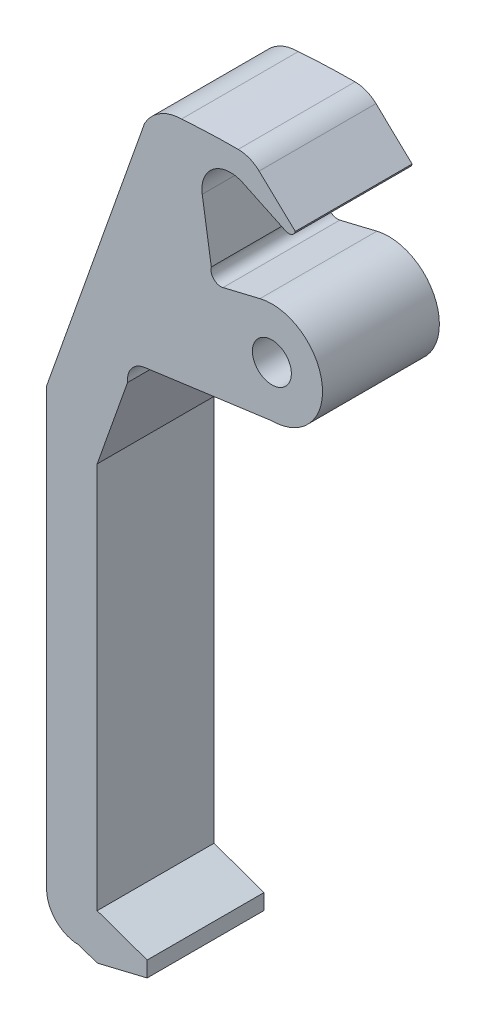
ISO-10303-21;
HEADER;
FILE_DESCRIPTION(('STEP AP214'),'2;1');
FILE_NAME('part.step','',(''),(''),'','','');
FILE_SCHEMA(('AUTOMOTIVE_DESIGN { 1 0 10303 214 1 1 1 1 }'));
ENDSEC;
DATA;
#1=APPLICATION_CONTEXT('core data for automotive mechanical design processes');
#2=APPLICATION_PROTOCOL_DEFINITION('international standard','automotive_design',2000,#1);
#3=PRODUCT_CONTEXT('',#1,'mechanical');
#4=PRODUCT('Part','Part','',(#3));
#5=PRODUCT_RELATED_PRODUCT_CATEGORY('part','',(#4));
#6=PRODUCT_DEFINITION_FORMATION('','',#4);
#7=PRODUCT_DEFINITION_CONTEXT('part definition',#1,'design');
#8=PRODUCT_DEFINITION('design','',#6,#7);
#9=PRODUCT_DEFINITION_SHAPE('','',#8);
#10=(LENGTH_UNIT() NAMED_UNIT(*) SI_UNIT(.MILLI.,.METRE.));
#11=(NAMED_UNIT(*) PLANE_ANGLE_UNIT() SI_UNIT($,.RADIAN.));
#12=(NAMED_UNIT(*) SI_UNIT($,.STERADIAN.) SOLID_ANGLE_UNIT());
#13=UNCERTAINTY_MEASURE_WITH_UNIT(LENGTH_MEASURE(1.E-05),#10,'distance_accuracy_value','');
#14=(GEOMETRIC_REPRESENTATION_CONTEXT(3) GLOBAL_UNCERTAINTY_ASSIGNED_CONTEXT((#13)) GLOBAL_UNIT_ASSIGNED_CONTEXT((#10,
#11,#12)) REPRESENTATION_CONTEXT('',''));
#15=CARTESIAN_POINT('',(0.,0.,0.));
#16=DIRECTION('',(0.,0.,1.));
#17=DIRECTION('',(1.,0.,0.));
#18=AXIS2_PLACEMENT_3D('',#15,#16,#17);
#19=CARTESIAN_POINT('',(-4.51569484594409,5.22423534933692,6.));
#20=DIRECTION('',(0.,0.,-1.));
#21=DIRECTION('',(-1.,0.,0.));
#22=AXIS2_PLACEMENT_3D('',#19,#20,#21);
#23=PLANE('',#22);
#24=CARTESIAN_POINT('',(-4.51569484594409,5.22423534933692,6.));
#25=DIRECTION('',(0.,0.,1.));
#26=DIRECTION('',(-1.,0.,0.));
#27=AXIS2_PLACEMENT_3D('',#24,#25,#26);
#28=CIRCLE('',#27,2.60114486006778);
#29=CARTESIAN_POINT('',(-4.51569484594409,2.62309048926914,6.));
#30=VERTEX_POINT('',#29);
#31=CARTESIAN_POINT('',(-5.12560105891966,7.75286521438851,6.));
#32=VERTEX_POINT('',#31);
#33=EDGE_CURVE('E290',#30,#32,#28,.T.);
#34=ORIENTED_EDGE('',*,*,#33,.T.);
#35=DIRECTION('',(-0.972121892890541,-0.234476065650446,0.));
#36=VECTOR('',#35,1.);
#37=CARTESIAN_POINT('',(-5.12560105891966,7.75286521438851,6.));
#38=LINE('',#37,#36);
#39=CARTESIAN_POINT('',(-7.02560105891966,7.29458469628273,6.));
#40=VERTEX_POINT('',#39);
#41=EDGE_CURVE('E142',#32,#40,#38,.T.);
#42=ORIENTED_EDGE('',*,*,#41,.T.);
#43=CARTESIAN_POINT('',(-7.14283909174488,7.780645642728,6.));
#44=DIRECTION('',(0.,0.,-1.));
#45=DIRECTION('',(-1.,0.,0.));
#46=AXIS2_PLACEMENT_3D('',#43,#44,#45);
#47=CIRCLE('',#46,0.5);
#48=CARTESIAN_POINT('',(-7.62521914813079,7.91221114428951,6.));
#49=VERTEX_POINT('',#48);
#50=EDGE_CURVE('E367',#40,#49,#47,.T.);
#51=ORIENTED_EDGE('',*,*,#50,.T.);
#52=DIRECTION('',(-0.153679161681778,0.988120799935304,0.));
#53=VECTOR('',#52,1.);
#54=CARTESIAN_POINT('',(-7.62521914813079,7.91221114428951,6.));
#55=LINE('',#54,#53);
#56=CARTESIAN_POINT('',(-8.09179923133065,10.9122111442895,6.));
#57=VERTEX_POINT('',#56);
#58=EDGE_CURVE('E387',#49,#57,#55,.T.);
#59=ORIENTED_EDGE('',*,*,#58,.T.);
#60=CARTESIAN_POINT('',(-6.64156246662134,11.137761674402,6.));
#61=DIRECTION('',(0.,0.,-1.));
#62=DIRECTION('',(-1.,0.,0.));
#63=AXIS2_PLACEMENT_3D('',#60,#61,#62);
#64=CIRCLE('',#63,1.46767152842473);
#65=CARTESIAN_POINT('',(-6.01507453611189,12.4650041497149,6.));
#66=VERTEX_POINT('',#65);
#67=EDGE_CURVE('E383',#57,#66,#64,.T.);
#68=ORIENTED_EDGE('',*,*,#67,.T.);
#69=DIRECTION('',(0.904318472906124,-0.426858406922876,0.));
#70=VECTOR('',#69,1.);
#71=CARTESIAN_POINT('',(-6.01507453611189,12.4650041497149,6.));
#72=LINE('',#71,#70);
#73=CARTESIAN_POINT('',(-3.79657696969492,11.4178240186712,6.));
#74=VERTEX_POINT('',#73);
#75=EDGE_CURVE('E386',#66,#74,#72,.T.);
#76=ORIENTED_EDGE('',*,*,#75,.T.);
#77=CARTESIAN_POINT('',(-3.64917409070544,11.7301035574313,6.));
#78=DIRECTION('',(0.,0.,1.));
#79=DIRECTION('',(1.,0.,0.));
#80=AXIS2_PLACEMENT_3D('',#77,#78,#79);
#81=CIRCLE('',#80,0.345320313712618);
#82=CARTESIAN_POINT('',(-3.31403457068977,11.6468712248541,6.));
#83=VERTEX_POINT('',#82);
#84=EDGE_CURVE('E391',#74,#83,#81,.T.);
#85=ORIENTED_EDGE('',*,*,#84,.T.);
#86=DIRECTION('',(-0.726400675585128,0.68727145911166,0.));
#87=VECTOR('',#86,1.);
#88=CARTESIAN_POINT('',(-5.17045698150236,13.4032932408152,6.));
#89=LINE('',#88,#87);
#90=CARTESIAN_POINT('',(-5.17045698150236,13.4032932408152,6.));
#91=VERTEX_POINT('',#90);
#92=EDGE_CURVE('E398',#83,#91,#89,.T.);
#93=ORIENTED_EDGE('',*,*,#92,.T.);
#94=CARTESIAN_POINT('',(-6.24608790659032,12.2664221830907,6.));
#95=DIRECTION('',(0.,0.,1.));
#96=DIRECTION('',(1.,0.,0.));
#97=AXIS2_PLACEMENT_3D('',#94,#95,#96);
#98=CIRCLE('',#97,1.56507433973511);
#99=CARTESIAN_POINT('',(-6.24608790659033,13.8314965228258,6.));
#100=VERTEX_POINT('',#99);
#101=EDGE_CURVE('E401',#91,#100,#98,.T.);
#102=ORIENTED_EDGE('',*,*,#101,.T.);
#103=CARTESIAN_POINT('',(-6.24608790659035,-25.6395132829265,6.));
#104=DIRECTION('',(0.,0.,1.));
#105=DIRECTION('',(1.,0.,0.));
#106=AXIS2_PLACEMENT_3D('',#103,#104,#105);
#107=CIRCLE('',#106,39.4710098057523);
#108=CARTESIAN_POINT('',(-9.15758206236001,13.7239700089102,6.));
#109=VERTEX_POINT('',#108);
#110=EDGE_CURVE('E404',#100,#109,#107,.T.);
#111=ORIENTED_EDGE('',*,*,#110,.T.);
#112=CARTESIAN_POINT('',(-9.14121457217017,11.5551703749708,6.));
#113=DIRECTION('',(0.,0.,1.));
#114=DIRECTION('',(1.,0.,0.));
#115=AXIS2_PLACEMENT_3D('',#112,#113,#114);
#116=CIRCLE('',#115,2.16886139412158);
#117=CARTESIAN_POINT('',(-11.0574923889032,12.5709651751189,6.));
#118=VERTEX_POINT('',#117);
#119=EDGE_CURVE('E407',#109,#118,#116,.T.);
#120=ORIENTED_EDGE('',*,*,#119,.T.);
#121=DIRECTION('',(-0.334181818049273,-0.942508627273662,0.));
#122=VECTOR('',#121,1.);
#123=CARTESIAN_POINT('',(-11.0574923889032,12.5709651751189,6.));
#124=LINE('',#123,#122);
#125=CARTESIAN_POINT('',(-16.0830356074001,-1.60280965146838,6.));
#126=VERTEX_POINT('',#125);
#127=EDGE_CURVE('E410',#118,#126,#124,.T.);
#128=ORIENTED_EDGE('',*,*,#127,.T.);
#129=DIRECTION('',(0.,-1.,0.));
#130=VECTOR('',#129,1.);
#131=CARTESIAN_POINT('',(-16.0830356074001,-1.60280965146838,6.));
#132=LINE('',#131,#130);
#133=CARTESIAN_POINT('',(-16.0830356074001,-23.98824008561,6.));
#134=VERTEX_POINT('',#133);
#135=EDGE_CURVE('E413',#126,#134,#132,.T.);
#136=ORIENTED_EDGE('',*,*,#135,.T.);
#137=CARTESIAN_POINT('',(-14.4317624100835,-23.98824008561,6.));
#138=DIRECTION('',(0.,0.,1.));
#139=DIRECTION('',(1.,0.,0.));
#140=AXIS2_PLACEMENT_3D('',#137,#138,#139);
#141=CIRCLE('',#140,1.65127319731652);
#142=CARTESIAN_POINT('',(-14.4317624100835,-25.6395132829265,6.));
#143=VERTEX_POINT('',#142);
#144=EDGE_CURVE('E416',#134,#143,#141,.T.);
#145=ORIENTED_EDGE('',*,*,#144,.T.);
#146=DIRECTION('',(0.942508627273663,-0.334181818049271,0.));
#147=VECTOR('',#146,1.);
#148=CARTESIAN_POINT('',(-14.4317624100835,-25.6395132829265,6.));
#149=LINE('',#148,#147);
#150=CARTESIAN_POINT('',(-13.4868082342411,-25.9745622101387,6.));
#151=VERTEX_POINT('',#150);
#152=EDGE_CURVE('E419',#143,#151,#149,.T.);
#153=ORIENTED_EDGE('',*,*,#152,.T.);
#154=DIRECTION('',(0.972121892890541,0.234476065650445,0.));
#155=VECTOR('',#154,1.);
#156=CARTESIAN_POINT('',(-13.4868082342411,-25.9745622101387,6.));
#157=LINE('',#156,#155);
#158=CARTESIAN_POINT('',(-10.9206699236474,-25.3556089498703,6.));
#159=VERTEX_POINT('',#158);
#160=EDGE_CURVE('E422',#151,#159,#157,.T.);
#161=ORIENTED_EDGE('',*,*,#160,.T.);
#162=DIRECTION('',(0.,1.,0.));
#163=VECTOR('',#162,1.);
#164=CARTESIAN_POINT('',(-10.9206699236474,-25.3556089498703,6.));
#165=LINE('',#164,#163);
#166=CARTESIAN_POINT('',(-10.9206699236474,-24.5561648234885,6.));
#167=VERTEX_POINT('',#166);
#168=EDGE_CURVE('E425',#159,#167,#165,.T.);
#169=ORIENTED_EDGE('',*,*,#168,.T.);
#170=DIRECTION('',(-0.942508627273662,0.334181818049272,0.));
#171=VECTOR('',#170,1.);
#172=CARTESIAN_POINT('',(-10.9206699236474,-24.5561648234885,6.));
#173=LINE('',#172,#171);
#174=CARTESIAN_POINT('',(-13.4868082342411,-23.6462985992602,6.));
#175=VERTEX_POINT('',#174);
#176=EDGE_CURVE('E428',#167,#175,#173,.T.);
#177=ORIENTED_EDGE('',*,*,#176,.T.);
#178=DIRECTION('',(0.,1.,0.));
#179=VECTOR('',#178,1.);
#180=CARTESIAN_POINT('',(-13.4868082342411,-3.77637007716617,6.));
#181=LINE('',#180,#179);
#182=CARTESIAN_POINT('',(-13.4868082342411,-3.77637007716617,6.));
#183=VERTEX_POINT('',#182);
#184=EDGE_CURVE('E203',#175,#183,#181,.T.);
#185=ORIENTED_EDGE('',*,*,#184,.T.);
#186=DIRECTION('',(0.334181818049273,0.942508627273662,0.));
#187=VECTOR('',#186,1.);
#188=CARTESIAN_POINT('',(-11.9273381380971,0.621876446749646,6.));
#189=LINE('',#188,#187);
#190=CARTESIAN_POINT('',(-11.9273381380971,0.621876446749646,6.));
#191=VERTEX_POINT('',#190);
#192=EDGE_CURVE('E197',#183,#191,#189,.T.);
#193=ORIENTED_EDGE('',*,*,#192,.T.);
#194=CARTESIAN_POINT('',(-10.9206699236474,0.727710893237151,6.));
#195=DIRECTION('',(0.,0.,-1.));
#196=DIRECTION('',(1.,0.,0.));
#197=AXIS2_PLACEMENT_3D('',#194,#195,#196);
#198=CIRCLE('',#197,1.01221629311453);
#199=CARTESIAN_POINT('',(-11.0574923889032,1.73063732974576,6.));
#200=VERTEX_POINT('',#199);
#201=EDGE_CURVE('E201',#191,#200,#198,.T.);
#202=ORIENTED_EDGE('',*,*,#201,.T.);
#203=DIRECTION('',(0.990822261339684,0.135171174566604,0.));
#204=VECTOR('',#203,1.);
#205=CARTESIAN_POINT('',(-4.51569484594409,2.62309048926914,6.));
#206=LINE('',#205,#204);
#207=EDGE_CURVE('E57',#200,#30,#206,.T.);
#208=ORIENTED_EDGE('',*,*,#207,.T.);
#209=EDGE_LOOP('',(#34,#42,#51,#59,#68,#76,#85,#93,#102,#111,#120,#128,#136,#145,#153,#161,#169,
#177,#185,#193,#202,#208));
#210=FACE_BOUND('',#209,.T.);
#211=CARTESIAN_POINT('',(-4.51569484594409,5.22423534933692,6.));
#212=DIRECTION('',(0.,0.,1.));
#213=DIRECTION('',(1.,0.,0.));
#214=AXIS2_PLACEMENT_3D('',#211,#212,#213);
#215=CIRCLE('',#214,1.);
#216=CARTESIAN_POINT('',(-3.51569484594409,5.22423534933692,6.));
#217=VERTEX_POINT('',#216);
#218=EDGE_CURVE('E230',#217,#217,#215,.T.);
#219=ORIENTED_EDGE('',*,*,#218,.F.);
#220=EDGE_LOOP('',(#219));
#221=FACE_BOUND('',#220,.T.);
#222=ADVANCED_FACE('F39',(#210,#221),#23,.F.);
#223=CARTESIAN_POINT('',(-4.51569484594409,5.22423534933692,0.));
#224=DIRECTION('',(0.,0.,-1.));
#225=DIRECTION('',(-1.,0.,0.));
#226=AXIS2_PLACEMENT_3D('',#223,#224,#225);
#227=PLANE('',#226);
#228=CARTESIAN_POINT('',(-4.51569484594409,5.22423534933692,0.));
#229=DIRECTION('',(0.,0.,1.));
#230=DIRECTION('',(-1.,0.,0.));
#231=AXIS2_PLACEMENT_3D('',#228,#229,#230);
#232=CIRCLE('',#231,2.60114486006778);
#233=CARTESIAN_POINT('',(-4.51569484594409,2.62309048926914,0.));
#234=VERTEX_POINT('',#233);
#235=CARTESIAN_POINT('',(-5.12560105891966,7.75286521438851,0.));
#236=VERTEX_POINT('',#235);
#237=EDGE_CURVE('E225',#234,#236,#232,.T.);
#238=ORIENTED_EDGE('',*,*,#237,.F.);
#239=DIRECTION('',(0.990822261339684,0.135171174566604,0.));
#240=VECTOR('',#239,1.);
#241=CARTESIAN_POINT('',(-4.51569484594409,2.62309048926914,0.));
#242=LINE('',#241,#240);
#243=CARTESIAN_POINT('',(-11.0574923889032,1.73063732974576,0.));
#244=VERTEX_POINT('',#243);
#245=EDGE_CURVE('E134',#244,#234,#242,.T.);
#246=ORIENTED_EDGE('',*,*,#245,.F.);
#247=CARTESIAN_POINT('',(-10.9206699236474,0.727710893237151,0.));
#248=DIRECTION('',(0.,0.,-1.));
#249=DIRECTION('',(1.,0.,0.));
#250=AXIS2_PLACEMENT_3D('',#247,#248,#249);
#251=CIRCLE('',#250,1.01221629311453);
#252=CARTESIAN_POINT('',(-11.9273381380971,0.621876446749646,0.));
#253=VERTEX_POINT('',#252);
#254=EDGE_CURVE('E128',#253,#244,#251,.T.);
#255=ORIENTED_EDGE('',*,*,#254,.F.);
#256=DIRECTION('',(0.334181818049273,0.942508627273662,0.));
#257=VECTOR('',#256,1.);
#258=CARTESIAN_POINT('',(-11.9273381380971,0.621876446749646,0.));
#259=LINE('',#258,#257);
#260=CARTESIAN_POINT('',(-13.4868082342411,-3.77637007716617,0.));
#261=VERTEX_POINT('',#260);
#262=EDGE_CURVE('E212',#261,#253,#259,.T.);
#263=ORIENTED_EDGE('',*,*,#262,.F.);
#264=DIRECTION('',(0.,1.,0.));
#265=VECTOR('',#264,1.);
#266=CARTESIAN_POINT('',(-13.4868082342411,-3.77637007716617,0.));
#267=LINE('',#266,#265);
#268=CARTESIAN_POINT('',(-13.4868082342411,-23.6462985992602,0.));
#269=VERTEX_POINT('',#268);
#270=EDGE_CURVE('E281',#269,#261,#267,.T.);
#271=ORIENTED_EDGE('',*,*,#270,.F.);
#272=DIRECTION('',(-0.942508627273662,0.334181818049272,0.));
#273=VECTOR('',#272,1.);
#274=CARTESIAN_POINT('',(-10.9206699236474,-24.5561648234885,0.));
#275=LINE('',#274,#273);
#276=CARTESIAN_POINT('',(-10.9206699236474,-24.5561648234885,0.));
#277=VERTEX_POINT('',#276);
#278=EDGE_CURVE('E278',#277,#269,#275,.T.);
#279=ORIENTED_EDGE('',*,*,#278,.F.);
#280=DIRECTION('',(0.,1.,0.));
#281=VECTOR('',#280,1.);
#282=CARTESIAN_POINT('',(-10.9206699236474,-25.3556089498703,0.));
#283=LINE('',#282,#281);
#284=CARTESIAN_POINT('',(-10.9206699236474,-25.3556089498703,0.));
#285=VERTEX_POINT('',#284);
#286=EDGE_CURVE('E275',#285,#277,#283,.T.);
#287=ORIENTED_EDGE('',*,*,#286,.F.);
#288=DIRECTION('',(0.972121892890541,0.234476065650445,0.));
#289=VECTOR('',#288,1.);
#290=CARTESIAN_POINT('',(-13.4868082342411,-25.9745622101387,0.));
#291=LINE('',#290,#289);
#292=CARTESIAN_POINT('',(-13.4868082342411,-25.9745622101387,0.));
#293=VERTEX_POINT('',#292);
#294=EDGE_CURVE('E272',#293,#285,#291,.T.);
#295=ORIENTED_EDGE('',*,*,#294,.F.);
#296=DIRECTION('',(0.942508627273663,-0.334181818049271,0.));
#297=VECTOR('',#296,1.);
#298=CARTESIAN_POINT('',(-14.4317624100835,-25.6395132829265,0.));
#299=LINE('',#298,#297);
#300=CARTESIAN_POINT('',(-14.4317624100835,-25.6395132829265,0.));
#301=VERTEX_POINT('',#300);
#302=EDGE_CURVE('E269',#301,#293,#299,.T.);
#303=ORIENTED_EDGE('',*,*,#302,.F.);
#304=CARTESIAN_POINT('',(-14.4317624100835,-23.98824008561,0.));
#305=DIRECTION('',(0.,0.,1.));
#306=DIRECTION('',(1.,0.,0.));
#307=AXIS2_PLACEMENT_3D('',#304,#305,#306);
#308=CIRCLE('',#307,1.65127319731652);
#309=CARTESIAN_POINT('',(-16.0830356074001,-23.98824008561,0.));
#310=VERTEX_POINT('',#309);
#311=EDGE_CURVE('E266',#310,#301,#308,.T.);
#312=ORIENTED_EDGE('',*,*,#311,.F.);
#313=DIRECTION('',(0.,-1.,0.));
#314=VECTOR('',#313,1.);
#315=CARTESIAN_POINT('',(-16.0830356074001,-1.60280965146838,0.));
#316=LINE('',#315,#314);
#317=CARTESIAN_POINT('',(-16.0830356074001,-1.60280965146838,0.));
#318=VERTEX_POINT('',#317);
#319=EDGE_CURVE('E263',#318,#310,#316,.T.);
#320=ORIENTED_EDGE('',*,*,#319,.F.);
#321=DIRECTION('',(-0.334181818049273,-0.942508627273662,0.));
#322=VECTOR('',#321,1.);
#323=CARTESIAN_POINT('',(-11.0574923889032,12.5709651751189,0.));
#324=LINE('',#323,#322);
#325=CARTESIAN_POINT('',(-11.0574923889032,12.5709651751189,0.));
#326=VERTEX_POINT('',#325);
#327=EDGE_CURVE('E260',#326,#318,#324,.T.);
#328=ORIENTED_EDGE('',*,*,#327,.F.);
#329=CARTESIAN_POINT('',(-9.14121457217017,11.5551703749708,0.));
#330=DIRECTION('',(0.,0.,1.));
#331=DIRECTION('',(1.,0.,0.));
#332=AXIS2_PLACEMENT_3D('',#329,#330,#331);
#333=CIRCLE('',#332,2.16886139412158);
#334=CARTESIAN_POINT('',(-9.15758206236001,13.7239700089102,0.));
#335=VERTEX_POINT('',#334);
#336=EDGE_CURVE('E257',#335,#326,#333,.T.);
#337=ORIENTED_EDGE('',*,*,#336,.F.);
#338=CARTESIAN_POINT('',(-6.24608790659035,-25.6395132829265,0.));
#339=DIRECTION('',(0.,0.,1.));
#340=DIRECTION('',(1.,0.,0.));
#341=AXIS2_PLACEMENT_3D('',#338,#339,#340);
#342=CIRCLE('',#341,39.4710098057523);
#343=CARTESIAN_POINT('',(-6.24608790659033,13.8314965228258,0.));
#344=VERTEX_POINT('',#343);
#345=EDGE_CURVE('E254',#344,#335,#342,.T.);
#346=ORIENTED_EDGE('',*,*,#345,.F.);
#347=CARTESIAN_POINT('',(-6.24608790659032,12.2664221830907,0.));
#348=DIRECTION('',(0.,0.,1.));
#349=DIRECTION('',(1.,0.,0.));
#350=AXIS2_PLACEMENT_3D('',#347,#348,#349);
#351=CIRCLE('',#350,1.56507433973511);
#352=CARTESIAN_POINT('',(-5.17045698150236,13.4032932408152,0.));
#353=VERTEX_POINT('',#352);
#354=EDGE_CURVE('E251',#353,#344,#351,.T.);
#355=ORIENTED_EDGE('',*,*,#354,.F.);
#356=DIRECTION('',(-0.726400675585128,0.68727145911166,0.));
#357=VECTOR('',#356,1.);
#358=CARTESIAN_POINT('',(-5.17045698150236,13.4032932408152,0.));
#359=LINE('',#358,#357);
#360=CARTESIAN_POINT('',(-3.31403457068977,11.6468712248541,0.));
#361=VERTEX_POINT('',#360);
#362=EDGE_CURVE('E248',#361,#353,#359,.T.);
#363=ORIENTED_EDGE('',*,*,#362,.F.);
#364=CARTESIAN_POINT('',(-3.64917409070544,11.7301035574313,0.));
#365=DIRECTION('',(0.,0.,1.));
#366=DIRECTION('',(1.,0.,0.));
#367=AXIS2_PLACEMENT_3D('',#364,#365,#366);
#368=CIRCLE('',#367,0.345320313712618);
#369=CARTESIAN_POINT('',(-3.79657696969492,11.4178240186712,0.));
#370=VERTEX_POINT('',#369);
#371=EDGE_CURVE('E245',#370,#361,#368,.T.);
#372=ORIENTED_EDGE('',*,*,#371,.F.);
#373=DIRECTION('',(0.904318472906124,-0.426858406922876,0.));
#374=VECTOR('',#373,1.);
#375=CARTESIAN_POINT('',(-6.01507453611189,12.4650041497149,0.));
#376=LINE('',#375,#374);
#377=CARTESIAN_POINT('',(-6.01507453611189,12.4650041497149,0.));
#378=VERTEX_POINT('',#377);
#379=EDGE_CURVE('E242',#378,#370,#376,.T.);
#380=ORIENTED_EDGE('',*,*,#379,.F.);
#381=CARTESIAN_POINT('',(-6.64156246662134,11.137761674402,0.));
#382=DIRECTION('',(0.,0.,-1.));
#383=DIRECTION('',(-1.,0.,0.));
#384=AXIS2_PLACEMENT_3D('',#381,#382,#383);
#385=CIRCLE('',#384,1.46767152842473);
#386=CARTESIAN_POINT('',(-8.09179923133065,10.9122111442895,0.));
#387=VERTEX_POINT('',#386);
#388=EDGE_CURVE('E239',#387,#378,#385,.T.);
#389=ORIENTED_EDGE('',*,*,#388,.F.);
#390=DIRECTION('',(-0.153679161681778,0.988120799935304,0.));
#391=VECTOR('',#390,1.);
#392=CARTESIAN_POINT('',(-7.62521914813079,7.91221114428951,0.));
#393=LINE('',#392,#391);
#394=CARTESIAN_POINT('',(-7.62521914813079,7.91221114428951,0.));
#395=VERTEX_POINT('',#394);
#396=EDGE_CURVE('E236',#395,#387,#393,.T.);
#397=ORIENTED_EDGE('',*,*,#396,.F.);
#398=CARTESIAN_POINT('',(-7.14283909174488,7.780645642728,0.));
#399=DIRECTION('',(0.,0.,-1.));
#400=DIRECTION('',(-1.,0.,0.));
#401=AXIS2_PLACEMENT_3D('',#398,#399,#400);
#402=CIRCLE('',#401,0.5);
#403=CARTESIAN_POINT('',(-7.02560105891966,7.29458469628273,0.));
#404=VERTEX_POINT('',#403);
#405=EDGE_CURVE('E233',#404,#395,#402,.T.);
#406=ORIENTED_EDGE('',*,*,#405,.F.);
#407=DIRECTION('',(-0.972121892890541,-0.234476065650446,0.));
#408=VECTOR('',#407,1.);
#409=CARTESIAN_POINT('',(-5.12560105891966,7.75286521438851,0.));
#410=LINE('',#409,#408);
#411=EDGE_CURVE('E229',#236,#404,#410,.T.);
#412=ORIENTED_EDGE('',*,*,#411,.F.);
#413=EDGE_LOOP('',(#238,#246,#255,#263,#271,#279,#287,#295,#303,#312,#320,#328,#337,#346,#355,
#363,#372,#380,#389,#397,#406,#412));
#414=FACE_BOUND('',#413,.T.);
#415=CARTESIAN_POINT('',(-4.51569484594409,5.22423534933692,0.));
#416=DIRECTION('',(0.,0.,1.));
#417=DIRECTION('',(1.,0.,0.));
#418=AXIS2_PLACEMENT_3D('',#415,#416,#417);
#419=CIRCLE('',#418,1.);
#420=CARTESIAN_POINT('',(-3.51569484594409,5.22423534933692,0.));
#421=VERTEX_POINT('',#420);
#422=EDGE_CURVE('E707',#421,#421,#419,.T.);
#423=ORIENTED_EDGE('',*,*,#422,.T.);
#424=EDGE_LOOP('',(#423));
#425=FACE_BOUND('',#424,.T.);
#426=ADVANCED_FACE('F371',(#414,#425),#227,.T.);
#427=CARTESIAN_POINT('',(-4.51569484594409,5.22423534933692,6.));
#428=DIRECTION('',(0.,0.,-1.));
#429=DIRECTION('',(-1.,0.,0.));
#430=AXIS2_PLACEMENT_3D('',#427,#428,#429);
#431=CYLINDRICAL_SURFACE('',#430,2.60114486006778);
#432=ORIENTED_EDGE('',*,*,#237,.T.);
#433=DIRECTION('',(0.,0.,-1.));
#434=VECTOR('',#433,1.);
#435=CARTESIAN_POINT('',(-5.12560105891966,7.75286521438851,6.));
#436=LINE('',#435,#434);
#437=EDGE_CURVE('E11',#32,#236,#436,.T.);
#438=ORIENTED_EDGE('',*,*,#437,.F.);
#439=ORIENTED_EDGE('',*,*,#33,.F.);
#440=DIRECTION('',(0.,0.,-1.));
#441=VECTOR('',#440,1.);
#442=CARTESIAN_POINT('',(-4.51569484594409,2.62309048926914,6.));
#443=LINE('',#442,#441);
#444=EDGE_CURVE('E221',#30,#234,#443,.T.);
#445=ORIENTED_EDGE('',*,*,#444,.T.);
#446=EDGE_LOOP('',(#432,#438,#439,#445));
#447=FACE_BOUND('',#446,.T.);
#448=ADVANCED_FACE('F41',(#447),#431,.T.);
#449=CARTESIAN_POINT('',(-5.12560105891966,7.75286521438851,6.));
#450=DIRECTION('',(0.234476065650446,-0.972121892890541,0.));
#451=DIRECTION('',(0.972121892890541,0.234476065650446,0.));
#452=AXIS2_PLACEMENT_3D('',#449,#450,#451);
#453=PLANE('',#452);
#454=ORIENTED_EDGE('',*,*,#411,.T.);
#455=DIRECTION('',(0.,0.,-1.));
#456=VECTOR('',#455,1.);
#457=CARTESIAN_POINT('',(-7.02560105891966,7.29458469628273,6.));
#458=LINE('',#457,#456);
#459=EDGE_CURVE('E49',#40,#404,#458,.T.);
#460=ORIENTED_EDGE('',*,*,#459,.F.);
#461=ORIENTED_EDGE('',*,*,#41,.F.);
#462=ORIENTED_EDGE('',*,*,#437,.T.);
#463=EDGE_LOOP('',(#454,#460,#461,#462));
#464=FACE_BOUND('',#463,.T.);
#465=ADVANCED_FACE('F464',(#464),#453,.F.);
#466=CARTESIAN_POINT('',(-7.14283909174488,7.780645642728,6.));
#467=DIRECTION('',(0.,0.,-1.));
#468=DIRECTION('',(-1.,0.,0.));
#469=AXIS2_PLACEMENT_3D('',#466,#467,#468);
#470=CYLINDRICAL_SURFACE('',#469,0.5);
#471=ORIENTED_EDGE('',*,*,#405,.T.);
#472=DIRECTION('',(0.,0.,-1.));
#473=VECTOR('',#472,1.);
#474=CARTESIAN_POINT('',(-7.62521914813079,7.91221114428951,6.));
#475=LINE('',#474,#473);
#476=EDGE_CURVE('E357',#49,#395,#475,.T.);
#477=ORIENTED_EDGE('',*,*,#476,.F.);
#478=ORIENTED_EDGE('',*,*,#50,.F.);
#479=ORIENTED_EDGE('',*,*,#459,.T.);
#480=EDGE_LOOP('',(#471,#477,#478,#479));
#481=FACE_BOUND('',#480,.T.);
#482=ADVANCED_FACE('F365',(#481),#470,.F.);
#483=CARTESIAN_POINT('',(-7.62521914813079,7.91221114428951,6.));
#484=DIRECTION('',(-0.988120799935304,-0.153679161681778,0.));
#485=DIRECTION('',(0.153679161681778,-0.988120799935305,0.));
#486=AXIS2_PLACEMENT_3D('',#483,#484,#485);
#487=PLANE('',#486);
#488=ORIENTED_EDGE('',*,*,#396,.T.);
#489=DIRECTION('',(0.,0.,-1.));
#490=VECTOR('',#489,1.);
#491=CARTESIAN_POINT('',(-8.09179923133065,10.9122111442895,6.));
#492=LINE('',#491,#490);
#493=EDGE_CURVE('E353',#57,#387,#492,.T.);
#494=ORIENTED_EDGE('',*,*,#493,.F.);
#495=ORIENTED_EDGE('',*,*,#58,.F.);
#496=ORIENTED_EDGE('',*,*,#476,.T.);
#497=EDGE_LOOP('',(#488,#494,#495,#496));
#498=FACE_BOUND('',#497,.T.);
#499=ADVANCED_FACE('F377',(#498),#487,.F.);
#500=CARTESIAN_POINT('',(-6.64156246662134,11.137761674402,6.));
#501=DIRECTION('',(0.,0.,-1.));
#502=DIRECTION('',(-1.,0.,0.));
#503=AXIS2_PLACEMENT_3D('',#500,#501,#502);
#504=CYLINDRICAL_SURFACE('',#503,1.46767152842473);
#505=ORIENTED_EDGE('',*,*,#388,.T.);
#506=DIRECTION('',(0.,0.,-1.));
#507=VECTOR('',#506,1.);
#508=CARTESIAN_POINT('',(-6.01507453611189,12.4650041497149,6.));
#509=LINE('',#508,#507);
#510=EDGE_CURVE('E349',#66,#378,#509,.T.);
#511=ORIENTED_EDGE('',*,*,#510,.F.);
#512=ORIENTED_EDGE('',*,*,#67,.F.);
#513=ORIENTED_EDGE('',*,*,#493,.T.);
#514=EDGE_LOOP('',(#505,#511,#512,#513));
#515=FACE_BOUND('',#514,.T.);
#516=ADVANCED_FACE('F381',(#515),#504,.F.);
#517=CARTESIAN_POINT('',(-6.01507453611189,12.4650041497149,6.));
#518=DIRECTION('',(0.426858406922876,0.904318472906124,0.));
#519=DIRECTION('',(-0.904318472906124,0.426858406922876,0.));
#520=AXIS2_PLACEMENT_3D('',#517,#518,#519);
#521=PLANE('',#520);
#522=ORIENTED_EDGE('',*,*,#379,.T.);
#523=DIRECTION('',(0.,0.,-1.));
#524=VECTOR('',#523,1.);
#525=CARTESIAN_POINT('',(-3.79657696969492,11.4178240186712,6.));
#526=LINE('',#525,#524);
#527=EDGE_CURVE('E345',#74,#370,#526,.T.);
#528=ORIENTED_EDGE('',*,*,#527,.F.);
#529=ORIENTED_EDGE('',*,*,#75,.F.);
#530=ORIENTED_EDGE('',*,*,#510,.T.);
#531=EDGE_LOOP('',(#522,#528,#529,#530));
#532=FACE_BOUND('',#531,.T.);
#533=ADVANCED_FACE('F477',(#532),#521,.F.);
#534=CARTESIAN_POINT('',(-3.64917409070544,11.7301035574313,6.));
#535=DIRECTION('',(0.,0.,-1.));
#536=DIRECTION('',(-1.,0.,0.));
#537=AXIS2_PLACEMENT_3D('',#534,#535,#536);
#538=CYLINDRICAL_SURFACE('',#537,0.345320313712618);
#539=ORIENTED_EDGE('',*,*,#371,.T.);
#540=DIRECTION('',(0.,0.,-1.));
#541=VECTOR('',#540,1.);
#542=CARTESIAN_POINT('',(-3.31403457068977,11.6468712248541,6.));
#543=LINE('',#542,#541);
#544=EDGE_CURVE('E341',#83,#361,#543,.T.);
#545=ORIENTED_EDGE('',*,*,#544,.F.);
#546=ORIENTED_EDGE('',*,*,#84,.F.);
#547=ORIENTED_EDGE('',*,*,#527,.T.);
#548=EDGE_LOOP('',(#539,#545,#546,#547));
#549=FACE_BOUND('',#548,.T.);
#550=ADVANCED_FACE('F480',(#549),#538,.T.);
#551=CARTESIAN_POINT('',(-5.17045698150236,13.4032932408152,6.));
#552=DIRECTION('',(-0.68727145911166,-0.726400675585128,0.));
#553=DIRECTION('',(0.726400675585128,-0.68727145911166,0.));
#554=AXIS2_PLACEMENT_3D('',#551,#552,#553);
#555=PLANE('',#554);
#556=ORIENTED_EDGE('',*,*,#362,.T.);
#557=DIRECTION('',(0.,0.,-1.));
#558=VECTOR('',#557,1.);
#559=CARTESIAN_POINT('',(-5.17045698150236,13.4032932408152,6.));
#560=LINE('',#559,#558);
#561=EDGE_CURVE('E337',#91,#353,#560,.T.);
#562=ORIENTED_EDGE('',*,*,#561,.F.);
#563=ORIENTED_EDGE('',*,*,#92,.F.);
#564=ORIENTED_EDGE('',*,*,#544,.T.);
#565=EDGE_LOOP('',(#556,#562,#563,#564));
#566=FACE_BOUND('',#565,.T.);
#567=ADVANCED_FACE('F484',(#566),#555,.F.);
#568=CARTESIAN_POINT('',(-6.24608790659032,12.2664221830907,6.));
#569=DIRECTION('',(0.,0.,-1.));
#570=DIRECTION('',(-1.,0.,0.));
#571=AXIS2_PLACEMENT_3D('',#568,#569,#570);
#572=CYLINDRICAL_SURFACE('',#571,1.56507433973511);
#573=ORIENTED_EDGE('',*,*,#354,.T.);
#574=DIRECTION('',(0.,0.,-1.));
#575=VECTOR('',#574,1.);
#576=CARTESIAN_POINT('',(-6.24608790659033,13.8314965228258,6.));
#577=LINE('',#576,#575);
#578=EDGE_CURVE('E333',#100,#344,#577,.T.);
#579=ORIENTED_EDGE('',*,*,#578,.F.);
#580=ORIENTED_EDGE('',*,*,#101,.F.);
#581=ORIENTED_EDGE('',*,*,#561,.T.);
#582=EDGE_LOOP('',(#573,#579,#580,#581));
#583=FACE_BOUND('',#582,.T.);
#584=ADVANCED_FACE('F488',(#583),#572,.T.);
#585=CARTESIAN_POINT('',(-6.24608790659035,-25.6395132829265,6.));
#586=DIRECTION('',(0.,0.,-1.));
#587=DIRECTION('',(-1.,0.,0.));
#588=AXIS2_PLACEMENT_3D('',#585,#586,#587);
#589=CYLINDRICAL_SURFACE('',#588,39.4710098057523);
#590=ORIENTED_EDGE('',*,*,#345,.T.);
#591=DIRECTION('',(0.,0.,-1.));
#592=VECTOR('',#591,1.);
#593=CARTESIAN_POINT('',(-9.15758206236001,13.7239700089102,6.));
#594=LINE('',#593,#592);
#595=EDGE_CURVE('E329',#109,#335,#594,.T.);
#596=ORIENTED_EDGE('',*,*,#595,.F.);
#597=ORIENTED_EDGE('',*,*,#110,.F.);
#598=ORIENTED_EDGE('',*,*,#578,.T.);
#599=EDGE_LOOP('',(#590,#596,#597,#598));
#600=FACE_BOUND('',#599,.T.);
#601=ADVANCED_FACE('F492',(#600),#589,.T.);
#602=CARTESIAN_POINT('',(-9.14121457217017,11.5551703749708,6.));
#603=DIRECTION('',(0.,0.,-1.));
#604=DIRECTION('',(-1.,0.,0.));
#605=AXIS2_PLACEMENT_3D('',#602,#603,#604);
#606=CYLINDRICAL_SURFACE('',#605,2.16886139412158);
#607=ORIENTED_EDGE('',*,*,#336,.T.);
#608=DIRECTION('',(0.,0.,-1.));
#609=VECTOR('',#608,1.);
#610=CARTESIAN_POINT('',(-11.0574923889032,12.5709651751189,6.));
#611=LINE('',#610,#609);
#612=EDGE_CURVE('E325',#118,#326,#611,.T.);
#613=ORIENTED_EDGE('',*,*,#612,.F.);
#614=ORIENTED_EDGE('',*,*,#119,.F.);
#615=ORIENTED_EDGE('',*,*,#595,.T.);
#616=EDGE_LOOP('',(#607,#613,#614,#615));
#617=FACE_BOUND('',#616,.T.);
#618=ADVANCED_FACE('F496',(#617),#606,.T.);
#619=CARTESIAN_POINT('',(-11.0574923889032,12.5709651751189,6.));
#620=DIRECTION('',(0.942508627273662,-0.334181818049273,0.));
#621=DIRECTION('',(0.334181818049273,0.942508627273662,0.));
#622=AXIS2_PLACEMENT_3D('',#619,#620,#621);
#623=PLANE('',#622);
#624=ORIENTED_EDGE('',*,*,#327,.T.);
#625=DIRECTION('',(0.,0.,-1.));
#626=VECTOR('',#625,1.);
#627=CARTESIAN_POINT('',(-16.0830356074001,-1.60280965146838,6.));
#628=LINE('',#627,#626);
#629=EDGE_CURVE('E321',#126,#318,#628,.T.);
#630=ORIENTED_EDGE('',*,*,#629,.F.);
#631=ORIENTED_EDGE('',*,*,#127,.F.);
#632=ORIENTED_EDGE('',*,*,#612,.T.);
#633=EDGE_LOOP('',(#624,#630,#631,#632));
#634=FACE_BOUND('',#633,.T.);
#635=ADVANCED_FACE('F500',(#634),#623,.F.);
#636=CARTESIAN_POINT('',(-16.0830356074001,-1.60280965146838,6.));
#637=DIRECTION('',(1.,0.,0.));
#638=DIRECTION('',(0.,1.,0.));
#639=AXIS2_PLACEMENT_3D('',#636,#637,#638);
#640=PLANE('',#639);
#641=ORIENTED_EDGE('',*,*,#319,.T.);
#642=DIRECTION('',(0.,0.,-1.));
#643=VECTOR('',#642,1.);
#644=CARTESIAN_POINT('',(-16.0830356074001,-23.98824008561,6.));
#645=LINE('',#644,#643);
#646=EDGE_CURVE('E317',#134,#310,#645,.T.);
#647=ORIENTED_EDGE('',*,*,#646,.F.);
#648=ORIENTED_EDGE('',*,*,#135,.F.);
#649=ORIENTED_EDGE('',*,*,#629,.T.);
#650=EDGE_LOOP('',(#641,#647,#648,#649));
#651=FACE_BOUND('',#650,.T.);
#652=ADVANCED_FACE('F504',(#651),#640,.F.);
#653=CARTESIAN_POINT('',(-14.4317624100835,-23.98824008561,6.));
#654=DIRECTION('',(0.,0.,-1.));
#655=DIRECTION('',(-1.,0.,0.));
#656=AXIS2_PLACEMENT_3D('',#653,#654,#655);
#657=CYLINDRICAL_SURFACE('',#656,1.65127319731652);
#658=ORIENTED_EDGE('',*,*,#311,.T.);
#659=DIRECTION('',(0.,0.,-1.));
#660=VECTOR('',#659,1.);
#661=CARTESIAN_POINT('',(-14.4317624100835,-25.6395132829265,6.));
#662=LINE('',#661,#660);
#663=EDGE_CURVE('E313',#143,#301,#662,.T.);
#664=ORIENTED_EDGE('',*,*,#663,.F.);
#665=ORIENTED_EDGE('',*,*,#144,.F.);
#666=ORIENTED_EDGE('',*,*,#646,.T.);
#667=EDGE_LOOP('',(#658,#664,#665,#666));
#668=FACE_BOUND('',#667,.T.);
#669=ADVANCED_FACE('F508',(#668),#657,.T.);
#670=CARTESIAN_POINT('',(-14.4317624100835,-25.6395132829265,6.));
#671=DIRECTION('',(0.334181818049271,0.942508627273662,0.));
#672=DIRECTION('',(-0.942508627273663,0.334181818049271,0.));
#673=AXIS2_PLACEMENT_3D('',#670,#671,#672);
#674=PLANE('',#673);
#675=ORIENTED_EDGE('',*,*,#302,.T.);
#676=DIRECTION('',(0.,0.,-1.));
#677=VECTOR('',#676,1.);
#678=CARTESIAN_POINT('',(-13.4868082342411,-25.9745622101387,6.));
#679=LINE('',#678,#677);
#680=EDGE_CURVE('E309',#151,#293,#679,.T.);
#681=ORIENTED_EDGE('',*,*,#680,.F.);
#682=ORIENTED_EDGE('',*,*,#152,.F.);
#683=ORIENTED_EDGE('',*,*,#663,.T.);
#684=EDGE_LOOP('',(#675,#681,#682,#683));
#685=FACE_BOUND('',#684,.T.);
#686=ADVANCED_FACE('F512',(#685),#674,.F.);
#687=CARTESIAN_POINT('',(-13.4868082342411,-25.9745622101387,6.));
#688=DIRECTION('',(-0.234476065650445,0.972121892890541,0.));
#689=DIRECTION('',(-0.972121892890541,-0.234476065650446,0.));
#690=AXIS2_PLACEMENT_3D('',#687,#688,#689);
#691=PLANE('',#690);
#692=ORIENTED_EDGE('',*,*,#294,.T.);
#693=DIRECTION('',(0.,0.,-1.));
#694=VECTOR('',#693,1.);
#695=CARTESIAN_POINT('',(-10.9206699236474,-25.3556089498703,6.));
#696=LINE('',#695,#694);
#697=EDGE_CURVE('E305',#159,#285,#696,.T.);
#698=ORIENTED_EDGE('',*,*,#697,.F.);
#699=ORIENTED_EDGE('',*,*,#160,.F.);
#700=ORIENTED_EDGE('',*,*,#680,.T.);
#701=EDGE_LOOP('',(#692,#698,#699,#700));
#702=FACE_BOUND('',#701,.T.);
#703=ADVANCED_FACE('F516',(#702),#691,.F.);
#704=CARTESIAN_POINT('',(-10.9206699236474,-25.3556089498703,6.));
#705=DIRECTION('',(-1.,0.,0.));
#706=DIRECTION('',(0.,0.,1.));
#707=AXIS2_PLACEMENT_3D('',#704,#705,#706);
#708=PLANE('',#707);
#709=ORIENTED_EDGE('',*,*,#286,.T.);
#710=DIRECTION('',(0.,0.,-1.));
#711=VECTOR('',#710,1.);
#712=CARTESIAN_POINT('',(-10.9206699236474,-24.5561648234885,6.));
#713=LINE('',#712,#711);
#714=EDGE_CURVE('E301',#167,#277,#713,.T.);
#715=ORIENTED_EDGE('',*,*,#714,.F.);
#716=ORIENTED_EDGE('',*,*,#168,.F.);
#717=ORIENTED_EDGE('',*,*,#697,.T.);
#718=EDGE_LOOP('',(#709,#715,#716,#717));
#719=FACE_BOUND('',#718,.T.);
#720=ADVANCED_FACE('F520',(#719),#708,.F.);
#721=CARTESIAN_POINT('',(-10.9206699236474,-24.5561648234885,6.));
#722=DIRECTION('',(-0.334181818049272,-0.942508627273662,0.));
#723=DIRECTION('',(0.942508627273662,-0.334181818049272,0.));
#724=AXIS2_PLACEMENT_3D('',#721,#722,#723);
#725=PLANE('',#724);
#726=ORIENTED_EDGE('',*,*,#278,.T.);
#727=DIRECTION('',(0.,0.,-1.));
#728=VECTOR('',#727,1.);
#729=CARTESIAN_POINT('',(-13.4868082342411,-23.6462985992602,6.));
#730=LINE('',#729,#728);
#731=EDGE_CURVE('E297',#175,#269,#730,.T.);
#732=ORIENTED_EDGE('',*,*,#731,.F.);
#733=ORIENTED_EDGE('',*,*,#176,.F.);
#734=ORIENTED_EDGE('',*,*,#714,.T.);
#735=EDGE_LOOP('',(#726,#732,#733,#734));
#736=FACE_BOUND('',#735,.T.);
#737=ADVANCED_FACE('F436',(#736),#725,.F.);
#738=CARTESIAN_POINT('',(-13.4868082342411,-3.77637007716617,6.));
#739=DIRECTION('',(-1.,0.,0.));
#740=DIRECTION('',(0.,-1.,0.));
#741=AXIS2_PLACEMENT_3D('',#738,#739,#740);
#742=PLANE('',#741);
#743=ORIENTED_EDGE('',*,*,#270,.T.);
#744=DIRECTION('',(0.,0.,-1.));
#745=VECTOR('',#744,1.);
#746=CARTESIAN_POINT('',(-13.4868082342411,-3.77637007716617,6.));
#747=LINE('',#746,#745);
#748=EDGE_CURVE('E214',#183,#261,#747,.T.);
#749=ORIENTED_EDGE('',*,*,#748,.F.);
#750=ORIENTED_EDGE('',*,*,#184,.F.);
#751=ORIENTED_EDGE('',*,*,#731,.T.);
#752=EDGE_LOOP('',(#743,#749,#750,#751));
#753=FACE_BOUND('',#752,.T.);
#754=ADVANCED_FACE('F440',(#753),#742,.F.);
#755=CARTESIAN_POINT('',(-11.9273381380971,0.621876446749646,6.));
#756=DIRECTION('',(-0.942508627273662,0.334181818049273,0.));
#757=DIRECTION('',(-0.334181818049273,-0.942508627273662,0.));
#758=AXIS2_PLACEMENT_3D('',#755,#756,#757);
#759=PLANE('',#758);
#760=ORIENTED_EDGE('',*,*,#262,.T.);
#761=DIRECTION('',(0.,0.,-1.));
#762=VECTOR('',#761,1.);
#763=CARTESIAN_POINT('',(-11.9273381380971,0.621876446749646,6.));
#764=LINE('',#763,#762);
#765=EDGE_CURVE('E209',#191,#253,#764,.T.);
#766=ORIENTED_EDGE('',*,*,#765,.F.);
#767=ORIENTED_EDGE('',*,*,#192,.F.);
#768=ORIENTED_EDGE('',*,*,#748,.T.);
#769=EDGE_LOOP('',(#760,#766,#767,#768));
#770=FACE_BOUND('',#769,.T.);
#771=ADVANCED_FACE('F210',(#770),#759,.F.);
#772=CARTESIAN_POINT('',(-10.9206699236474,0.727710893237151,6.));
#773=DIRECTION('',(0.,0.,-1.));
#774=DIRECTION('',(-1.,0.,0.));
#775=AXIS2_PLACEMENT_3D('',#772,#773,#774);
#776=CYLINDRICAL_SURFACE('',#775,1.01221629311453);
#777=ORIENTED_EDGE('',*,*,#254,.T.);
#778=DIRECTION('',(0.,0.,-1.));
#779=VECTOR('',#778,1.);
#780=CARTESIAN_POINT('',(-11.0574923889032,1.73063732974576,6.));
#781=LINE('',#780,#779);
#782=EDGE_CURVE('E215',#200,#244,#781,.T.);
#783=ORIENTED_EDGE('',*,*,#782,.F.);
#784=ORIENTED_EDGE('',*,*,#201,.F.);
#785=ORIENTED_EDGE('',*,*,#765,.T.);
#786=EDGE_LOOP('',(#777,#783,#784,#785));
#787=FACE_BOUND('',#786,.T.);
#788=ADVANCED_FACE('F217',(#787),#776,.F.);
#789=CARTESIAN_POINT('',(-4.51569484594409,2.62309048926914,6.));
#790=DIRECTION('',(-0.135171174566604,0.990822261339684,0.));
#791=DIRECTION('',(-0.990822261339684,-0.135171174566604,0.));
#792=AXIS2_PLACEMENT_3D('',#789,#790,#791);
#793=PLANE('',#792);
#794=ORIENTED_EDGE('',*,*,#245,.T.);
#795=ORIENTED_EDGE('',*,*,#444,.F.);
#796=ORIENTED_EDGE('',*,*,#207,.F.);
#797=ORIENTED_EDGE('',*,*,#782,.T.);
#798=EDGE_LOOP('',(#794,#795,#796,#797));
#799=FACE_BOUND('',#798,.T.);
#800=ADVANCED_FACE('F444',(#799),#793,.F.);
#801=CARTESIAN_POINT('',(-4.51569484594409,5.22423534933692,6.));
#802=DIRECTION('',(0.,0.,-1.));
#803=DIRECTION('',(-1.,0.,0.));
#804=AXIS2_PLACEMENT_3D('',#801,#802,#803);
#805=CYLINDRICAL_SURFACE('',#804,1.);
#806=ORIENTED_EDGE('',*,*,#218,.T.);
#807=EDGE_LOOP('',(#806));
#808=FACE_BOUND('',#807,.T.);
#809=ORIENTED_EDGE('',*,*,#422,.F.);
#810=EDGE_LOOP('',(#809));
#811=FACE_BOUND('',#810,.T.);
#812=ADVANCED_FACE('F446',(#808,#811),#805,.F.);
#813=CLOSED_SHELL('',(#222,#426,#448,#465,#482,#499,#516,#533,#550,#567,#584,#601,#618,#635,
#652,#669,#686,#703,#720,#737,#754,#771,#788,#800,#812));
#814=MANIFOLD_SOLID_BREP('B2',#813);
#815=ADVANCED_BREP_SHAPE_REPRESENTATION('',(#18,#814),#14);
#816=SHAPE_DEFINITION_REPRESENTATION(#9,#815);
ENDSEC;
END-ISO-10303-21;
